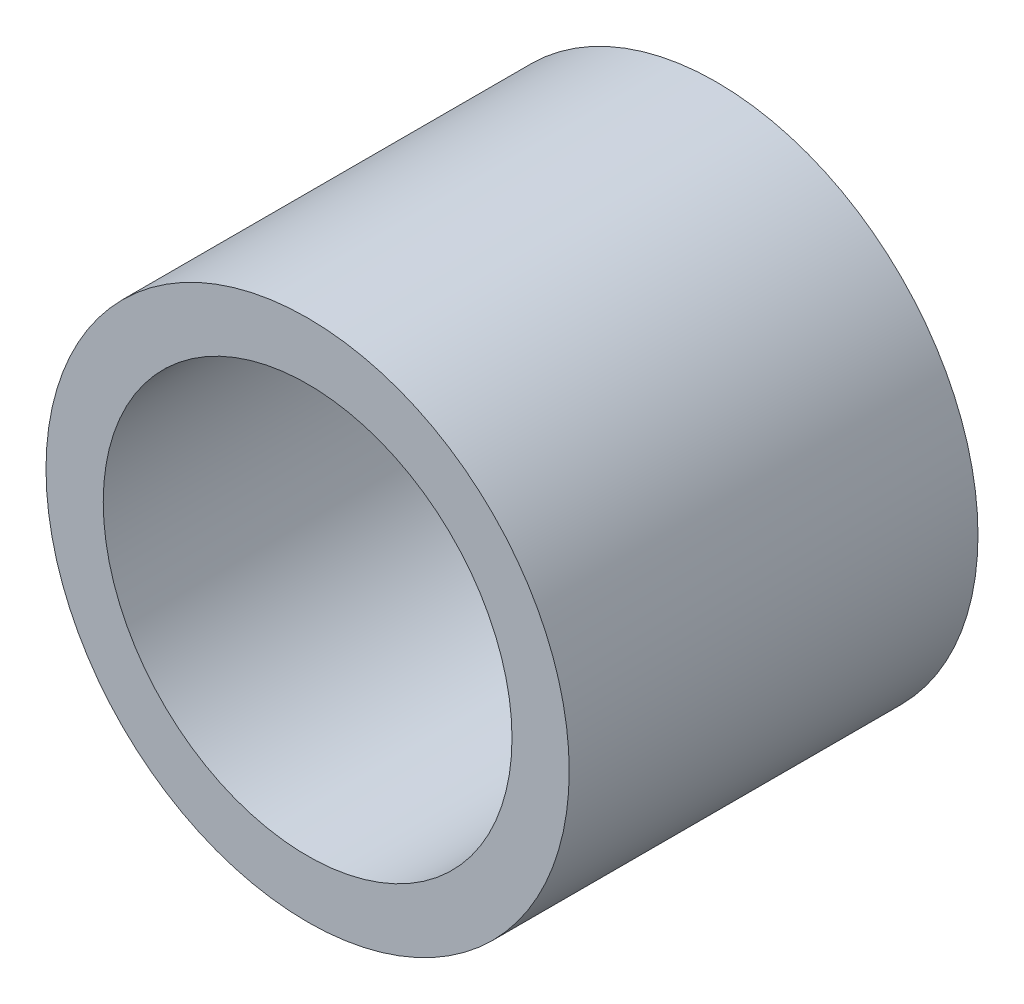
ISO-10303-21;
HEADER;
FILE_DESCRIPTION(('STEP AP214'),'2;1');
FILE_NAME('part.step','',(''),(''),'','','');
FILE_SCHEMA(('AUTOMOTIVE_DESIGN { 1 0 10303 214 1 1 1 1 }'));
ENDSEC;
DATA;
#1=APPLICATION_CONTEXT('core data for automotive mechanical design processes');
#2=APPLICATION_PROTOCOL_DEFINITION('international standard','automotive_design',2000,#1);
#3=PRODUCT_CONTEXT('',#1,'mechanical');
#4=PRODUCT('Part','Part','',(#3));
#5=PRODUCT_RELATED_PRODUCT_CATEGORY('part','',(#4));
#6=PRODUCT_DEFINITION_FORMATION('','',#4);
#7=PRODUCT_DEFINITION_CONTEXT('part definition',#1,'design');
#8=PRODUCT_DEFINITION('design','',#6,#7);
#9=PRODUCT_DEFINITION_SHAPE('','',#8);
#10=(LENGTH_UNIT() NAMED_UNIT(*) SI_UNIT(.MILLI.,.METRE.));
#11=(NAMED_UNIT(*) PLANE_ANGLE_UNIT() SI_UNIT($,.RADIAN.));
#12=(NAMED_UNIT(*) SI_UNIT($,.STERADIAN.) SOLID_ANGLE_UNIT());
#13=UNCERTAINTY_MEASURE_WITH_UNIT(LENGTH_MEASURE(1.E-05),#10,'distance_accuracy_value','');
#14=(GEOMETRIC_REPRESENTATION_CONTEXT(3) GLOBAL_UNCERTAINTY_ASSIGNED_CONTEXT((#13)) GLOBAL_UNIT_ASSIGNED_CONTEXT((#10,
#11,#12)) REPRESENTATION_CONTEXT('',''));
#15=CARTESIAN_POINT('',(0.,0.,0.));
#16=DIRECTION('',(0.,0.,1.));
#17=DIRECTION('',(1.,0.,0.));
#18=AXIS2_PLACEMENT_3D('',#15,#16,#17);
#19=CARTESIAN_POINT('',(0.,0.,12.5));
#20=DIRECTION('',(0.,0.,1.));
#21=DIRECTION('',(1.,0.,0.));
#22=AXIS2_PLACEMENT_3D('',#19,#20,#21);
#23=PLANE('',#22);
#24=CARTESIAN_POINT('',(0.,0.,12.5));
#25=DIRECTION('',(0.,0.,1.));
#26=DIRECTION('',(1.,0.,0.));
#27=AXIS2_PLACEMENT_3D('',#24,#25,#26);
#28=CIRCLE('',#27,16.);
#29=CARTESIAN_POINT('',(16.,0.,12.5));
#30=VERTEX_POINT('',#29);
#31=EDGE_CURVE('E10',#30,#30,#28,.T.);
#32=ORIENTED_EDGE('',*,*,#31,.T.);
#33=EDGE_LOOP('',(#32));
#34=FACE_BOUND('',#33,.T.);
#35=CARTESIAN_POINT('',(0.,0.,12.5));
#36=DIRECTION('',(0.,0.,1.));
#37=DIRECTION('',(1.,0.,0.));
#38=AXIS2_PLACEMENT_3D('',#35,#36,#37);
#39=CIRCLE('',#38,12.5);
#40=CARTESIAN_POINT('',(12.5,0.,12.5));
#41=VERTEX_POINT('',#40);
#42=EDGE_CURVE('E43',#41,#41,#39,.T.);
#43=ORIENTED_EDGE('',*,*,#42,.F.);
#44=EDGE_LOOP('',(#43));
#45=FACE_BOUND('',#44,.T.);
#46=ADVANCED_FACE('F32',(#34,#45),#23,.T.);
#47=CARTESIAN_POINT('',(0.,0.,-12.5));
#48=DIRECTION('',(0.,0.,1.));
#49=DIRECTION('',(1.,0.,0.));
#50=AXIS2_PLACEMENT_3D('',#47,#48,#49);
#51=PLANE('',#50);
#52=CARTESIAN_POINT('',(0.,0.,-12.5));
#53=DIRECTION('',(0.,0.,1.));
#54=DIRECTION('',(1.,0.,0.));
#55=AXIS2_PLACEMENT_3D('',#52,#53,#54);
#56=CIRCLE('',#55,16.);
#57=CARTESIAN_POINT('',(16.,0.,-12.5));
#58=VERTEX_POINT('',#57);
#59=EDGE_CURVE('E36',#58,#58,#56,.T.);
#60=ORIENTED_EDGE('',*,*,#59,.F.);
#61=EDGE_LOOP('',(#60));
#62=FACE_BOUND('',#61,.T.);
#63=CARTESIAN_POINT('',(0.,0.,-12.5));
#64=DIRECTION('',(0.,0.,1.));
#65=DIRECTION('',(1.,0.,0.));
#66=AXIS2_PLACEMENT_3D('',#63,#64,#65);
#67=CIRCLE('',#66,12.5);
#68=CARTESIAN_POINT('',(12.5,0.,-12.5));
#69=VERTEX_POINT('',#68);
#70=EDGE_CURVE('E45',#69,#69,#67,.T.);
#71=ORIENTED_EDGE('',*,*,#70,.T.);
#72=EDGE_LOOP('',(#71));
#73=FACE_BOUND('',#72,.T.);
#74=ADVANCED_FACE('F55',(#62,#73),#51,.F.);
#75=CARTESIAN_POINT('',(0.,0.,12.5));
#76=DIRECTION('',(0.,0.,-1.));
#77=DIRECTION('',(-1.,0.,0.));
#78=AXIS2_PLACEMENT_3D('',#75,#76,#77);
#79=CYLINDRICAL_SURFACE('',#78,16.);
#80=ORIENTED_EDGE('',*,*,#31,.F.);
#81=EDGE_LOOP('',(#80));
#82=FACE_BOUND('',#81,.T.);
#83=ORIENTED_EDGE('',*,*,#59,.T.);
#84=EDGE_LOOP('',(#83));
#85=FACE_BOUND('',#84,.T.);
#86=ADVANCED_FACE('F34',(#82,#85),#79,.T.);
#87=CARTESIAN_POINT('',(0.,0.,12.5));
#88=DIRECTION('',(0.,0.,-1.));
#89=DIRECTION('',(-1.,0.,0.));
#90=AXIS2_PLACEMENT_3D('',#87,#88,#89);
#91=CYLINDRICAL_SURFACE('',#90,12.5);
#92=ORIENTED_EDGE('',*,*,#42,.T.);
#93=EDGE_LOOP('',(#92));
#94=FACE_BOUND('',#93,.T.);
#95=ORIENTED_EDGE('',*,*,#70,.F.);
#96=EDGE_LOOP('',(#95));
#97=FACE_BOUND('',#96,.T.);
#98=ADVANCED_FACE('F51',(#94,#97),#91,.F.);
#99=CLOSED_SHELL('',(#46,#74,#86,#98));
#100=MANIFOLD_SOLID_BREP('B2',#99);
#101=ADVANCED_BREP_SHAPE_REPRESENTATION('',(#18,#100),#14);
#102=SHAPE_DEFINITION_REPRESENTATION(#9,#101);
ENDSEC;
END-ISO-10303-21;
